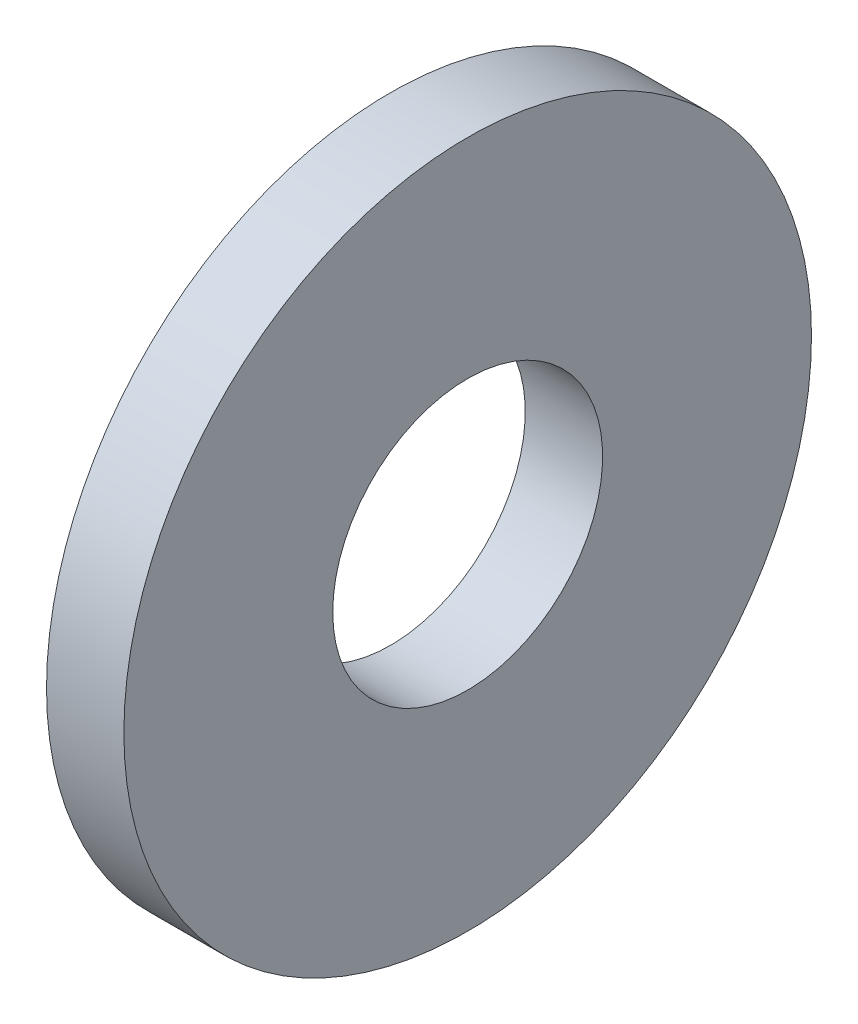
ISO-10303-21;
HEADER;
FILE_DESCRIPTION(('STEP AP214'),'2;1');
FILE_NAME('part.step','',(''),(''),'','','');
FILE_SCHEMA(('AUTOMOTIVE_DESIGN { 1 0 10303 214 1 1 1 1 }'));
ENDSEC;
DATA;
#1=APPLICATION_CONTEXT('core data for automotive mechanical design processes');
#2=APPLICATION_PROTOCOL_DEFINITION('international standard','automotive_design',2000,#1);
#3=PRODUCT_CONTEXT('',#1,'mechanical');
#4=PRODUCT('Part','Part','',(#3));
#5=PRODUCT_RELATED_PRODUCT_CATEGORY('part','',(#4));
#6=PRODUCT_DEFINITION_FORMATION('','',#4);
#7=PRODUCT_DEFINITION_CONTEXT('part definition',#1,'design');
#8=PRODUCT_DEFINITION('design','',#6,#7);
#9=PRODUCT_DEFINITION_SHAPE('','',#8);
#10=(LENGTH_UNIT() NAMED_UNIT(*) SI_UNIT(.MILLI.,.METRE.));
#11=(NAMED_UNIT(*) PLANE_ANGLE_UNIT() SI_UNIT($,.RADIAN.));
#12=(NAMED_UNIT(*) SI_UNIT($,.STERADIAN.) SOLID_ANGLE_UNIT());
#13=UNCERTAINTY_MEASURE_WITH_UNIT(LENGTH_MEASURE(1.E-05),#10,'distance_accuracy_value','');
#14=(GEOMETRIC_REPRESENTATION_CONTEXT(3) GLOBAL_UNCERTAINTY_ASSIGNED_CONTEXT((#13)) GLOBAL_UNIT_ASSIGNED_CONTEXT((#10,
#11,#12)) REPRESENTATION_CONTEXT('',''));
#15=CARTESIAN_POINT('',(0.,0.,0.));
#16=DIRECTION('',(0.,0.,1.));
#17=DIRECTION('',(1.,0.,0.));
#18=AXIS2_PLACEMENT_3D('',#15,#16,#17);
#19=CARTESIAN_POINT('',(-34.9249999999999,0.,0.));
#20=DIRECTION('',(-1.,0.,0.));
#21=DIRECTION('',(0.,0.,1.));
#22=AXIS2_PLACEMENT_3D('',#19,#20,#21);
#23=CYLINDRICAL_SURFACE('',#22,1.57);
#24=CARTESIAN_POINT('',(0.,0.,0.));
#25=DIRECTION('',(-1.,0.,0.));
#26=DIRECTION('',(0.,0.,1.));
#27=AXIS2_PLACEMENT_3D('',#24,#25,#26);
#28=CIRCLE('',#27,1.57);
#29=CARTESIAN_POINT('',(0.,0.,1.57));
#30=VERTEX_POINT('',#29);
#31=EDGE_CURVE('E10',#30,#30,#28,.T.);
#32=ORIENTED_EDGE('',*,*,#31,.F.);
#33=EDGE_LOOP('',(#32));
#34=FACE_BOUND('',#33,.T.);
#35=CARTESIAN_POINT('',(-0.899999999999998,0.,0.));
#36=DIRECTION('',(-1.,0.,0.));
#37=DIRECTION('',(0.,0.,1.));
#38=AXIS2_PLACEMENT_3D('',#35,#36,#37);
#39=CIRCLE('',#38,1.57);
#40=CARTESIAN_POINT('',(-0.899999999999998,0.,1.57));
#41=VERTEX_POINT('',#40);
#42=EDGE_CURVE('E45',#41,#41,#39,.T.);
#43=ORIENTED_EDGE('',*,*,#42,.T.);
#44=EDGE_LOOP('',(#43));
#45=FACE_BOUND('',#44,.T.);
#46=ADVANCED_FACE('F31',(#34,#45),#23,.F.);
#47=CARTESIAN_POINT('',(0.,1.57,0.));
#48=DIRECTION('',(-1.,0.,0.));
#49=DIRECTION('',(0.,0.,1.));
#50=AXIS2_PLACEMENT_3D('',#47,#48,#49);
#51=PLANE('',#50);
#52=CARTESIAN_POINT('',(0.,0.,0.));
#53=DIRECTION('',(-1.,0.,0.));
#54=DIRECTION('',(0.,0.,1.));
#55=AXIS2_PLACEMENT_3D('',#52,#53,#54);
#56=CIRCLE('',#55,4.);
#57=CARTESIAN_POINT('',(0.,0.,4.));
#58=VERTEX_POINT('',#57);
#59=EDGE_CURVE('E37',#58,#58,#56,.T.);
#60=ORIENTED_EDGE('',*,*,#59,.F.);
#61=EDGE_LOOP('',(#60));
#62=FACE_BOUND('',#61,.T.);
#63=ORIENTED_EDGE('',*,*,#31,.T.);
#64=EDGE_LOOP('',(#63));
#65=FACE_BOUND('',#64,.T.);
#66=ADVANCED_FACE('F60',(#62,#65),#51,.F.);
#67=CARTESIAN_POINT('',(-34.9249999999999,0.,0.));
#68=DIRECTION('',(-1.,0.,0.));
#69=DIRECTION('',(0.,0.,1.));
#70=AXIS2_PLACEMENT_3D('',#67,#68,#69);
#71=CYLINDRICAL_SURFACE('',#70,4.);
#72=CARTESIAN_POINT('',(-0.899999999999998,0.,0.));
#73=DIRECTION('',(-1.,0.,0.));
#74=DIRECTION('',(0.,0.,1.));
#75=AXIS2_PLACEMENT_3D('',#72,#73,#74);
#76=CIRCLE('',#75,4.);
#77=CARTESIAN_POINT('',(-0.899999999999998,0.,4.));
#78=VERTEX_POINT('',#77);
#79=EDGE_CURVE('E41',#78,#78,#76,.T.);
#80=ORIENTED_EDGE('',*,*,#79,.F.);
#81=EDGE_LOOP('',(#80));
#82=FACE_BOUND('',#81,.T.);
#83=ORIENTED_EDGE('',*,*,#59,.T.);
#84=EDGE_LOOP('',(#83));
#85=FACE_BOUND('',#84,.T.);
#86=ADVANCED_FACE('F55',(#82,#85),#71,.T.);
#87=CARTESIAN_POINT('',(-0.899999999999999,4.,0.));
#88=DIRECTION('',(1.,0.,0.));
#89=DIRECTION('',(0.,0.,-1.));
#90=AXIS2_PLACEMENT_3D('',#87,#88,#89);
#91=PLANE('',#90);
#92=ORIENTED_EDGE('',*,*,#42,.F.);
#93=EDGE_LOOP('',(#92));
#94=FACE_BOUND('',#93,.T.);
#95=ORIENTED_EDGE('',*,*,#79,.T.);
#96=EDGE_LOOP('',(#95));
#97=FACE_BOUND('',#96,.T.);
#98=ADVANCED_FACE('F52',(#94,#97),#91,.F.);
#99=CLOSED_SHELL('',(#46,#66,#86,#98));
#100=MANIFOLD_SOLID_BREP('B2',#99);
#101=ADVANCED_BREP_SHAPE_REPRESENTATION('',(#18,#100),#14);
#102=SHAPE_DEFINITION_REPRESENTATION(#9,#101);
ENDSEC;
END-ISO-10303-21;
